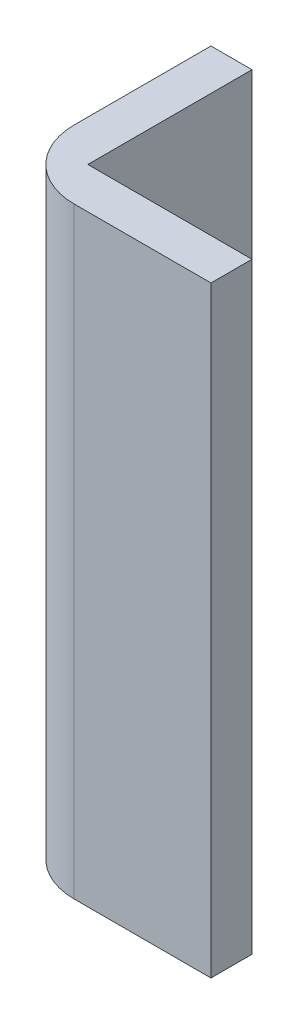
ISO-10303-21;
HEADER;
FILE_DESCRIPTION(('STEP AP214'),'2;1');
FILE_NAME('part.step','',(''),(''),'','','');
FILE_SCHEMA(('AUTOMOTIVE_DESIGN { 1 0 10303 214 1 1 1 1 }'));
ENDSEC;
DATA;
#1=APPLICATION_CONTEXT('core data for automotive mechanical design processes');
#2=APPLICATION_PROTOCOL_DEFINITION('international standard','automotive_design',2000,#1);
#3=PRODUCT_CONTEXT('',#1,'mechanical');
#4=PRODUCT('Part','Part','',(#3));
#5=PRODUCT_RELATED_PRODUCT_CATEGORY('part','',(#4));
#6=PRODUCT_DEFINITION_FORMATION('','',#4);
#7=PRODUCT_DEFINITION_CONTEXT('part definition',#1,'design');
#8=PRODUCT_DEFINITION('design','',#6,#7);
#9=PRODUCT_DEFINITION_SHAPE('','',#8);
#10=(LENGTH_UNIT() NAMED_UNIT(*) SI_UNIT(.MILLI.,.METRE.));
#11=(NAMED_UNIT(*) PLANE_ANGLE_UNIT() SI_UNIT($,.RADIAN.));
#12=(NAMED_UNIT(*) SI_UNIT($,.STERADIAN.) SOLID_ANGLE_UNIT());
#13=UNCERTAINTY_MEASURE_WITH_UNIT(LENGTH_MEASURE(1.E-05),#10,'distance_accuracy_value','');
#14=(GEOMETRIC_REPRESENTATION_CONTEXT(3) GLOBAL_UNCERTAINTY_ASSIGNED_CONTEXT((#13)) GLOBAL_UNIT_ASSIGNED_CONTEXT((#10,
#11,#12)) REPRESENTATION_CONTEXT('',''));
#15=CARTESIAN_POINT('',(0.,0.,0.));
#16=DIRECTION('',(0.,0.,1.));
#17=DIRECTION('',(1.,0.,0.));
#18=AXIS2_PLACEMENT_3D('',#15,#16,#17);
#19=CARTESIAN_POINT('',(-98.3544303797468,-0.0100000000000031,7.15189873417722));
#20=DIRECTION('',(0.,0.,1.));
#21=DIRECTION('',(1.,0.,0.));
#22=AXIS2_PLACEMENT_3D('',#19,#20,#21);
#23=PLANE('',#22);
#24=DIRECTION('',(-1.,0.,0.));
#25=VECTOR('',#24,1.);
#26=CARTESIAN_POINT('',(0.,3.,7.15189873417733));
#27=LINE('',#26,#25);
#28=CARTESIAN_POINT('',(-95.3544303797468,3.,7.15189873417722));
#29=VERTEX_POINT('',#28);
#30=CARTESIAN_POINT('',(-98.3544303797468,3.,7.15189873417722));
#31=VERTEX_POINT('',#30);
#32=EDGE_CURVE('E36',#29,#31,#27,.T.);
#33=ORIENTED_EDGE('',*,*,#32,.T.);
#34=DIRECTION('',(0.,-1.,0.));
#35=VECTOR('',#34,1.);
#36=CARTESIAN_POINT('',(-98.3544303797468,50.,7.15189873417722));
#37=LINE('',#36,#35);
#38=CARTESIAN_POINT('',(-98.3544303797468,47.,7.15189873417722));
#39=VERTEX_POINT('',#38);
#40=EDGE_CURVE('E130',#39,#31,#37,.T.);
#41=ORIENTED_EDGE('',*,*,#40,.F.);
#42=DIRECTION('',(1.,0.,0.));
#43=VECTOR('',#42,1.);
#44=CARTESIAN_POINT('',(0.,47.,7.15189873417733));
#45=LINE('',#44,#43);
#46=CARTESIAN_POINT('',(-95.3544303797468,47.,7.15189873417722));
#47=VERTEX_POINT('',#46);
#48=EDGE_CURVE('E123',#39,#47,#45,.T.);
#49=ORIENTED_EDGE('',*,*,#48,.T.);
#50=DIRECTION('',(0.,1.,0.));
#51=VECTOR('',#50,1.);
#52=CARTESIAN_POINT('',(-95.3544303797468,-0.0100000000000031,7.15189873417722));
#53=LINE('',#52,#51);
#54=EDGE_CURVE('E125',#29,#47,#53,.T.);
#55=ORIENTED_EDGE('',*,*,#54,.F.);
#56=EDGE_LOOP('',(#33,#41,#49,#55));
#57=FACE_BOUND('',#56,.T.);
#58=ADVANCED_FACE('F32',(#57),#23,.F.);
#59=CARTESIAN_POINT('',(-83.3544303797468,-0.0100000000000031,22.1518987341772));
#60=DIRECTION('',(-1.,0.,0.));
#61=DIRECTION('',(0.,0.,1.));
#62=AXIS2_PLACEMENT_3D('',#59,#60,#61);
#63=PLANE('',#62);
#64=DIRECTION('',(0.,0.,-1.));
#65=VECTOR('',#64,1.);
#66=CARTESIAN_POINT('',(-83.3544303797468,3.,0.));
#67=LINE('',#66,#65);
#68=CARTESIAN_POINT('',(-83.3544303797468,3.,22.1518987341772));
#69=VERTEX_POINT('',#68);
#70=CARTESIAN_POINT('',(-83.3544303797468,3.,19.1518987341772));
#71=VERTEX_POINT('',#70);
#72=EDGE_CURVE('E102',#69,#71,#67,.T.);
#73=ORIENTED_EDGE('',*,*,#72,.T.);
#74=DIRECTION('',(0.,1.,0.));
#75=VECTOR('',#74,1.);
#76=CARTESIAN_POINT('',(-83.3544303797468,-0.0100000000000031,19.1518987341772));
#77=LINE('',#76,#75);
#78=CARTESIAN_POINT('',(-83.3544303797468,47.,19.1518987341772));
#79=VERTEX_POINT('',#78);
#80=EDGE_CURVE('E94',#71,#79,#77,.T.);
#81=ORIENTED_EDGE('',*,*,#80,.T.);
#82=DIRECTION('',(0.,0.,1.));
#83=VECTOR('',#82,1.);
#84=CARTESIAN_POINT('',(-83.3544303797468,47.,0.));
#85=LINE('',#84,#83);
#86=CARTESIAN_POINT('',(-83.3544303797468,47.,22.1518987341772));
#87=VERTEX_POINT('',#86);
#88=EDGE_CURVE('E126',#79,#87,#85,.T.);
#89=ORIENTED_EDGE('',*,*,#88,.T.);
#90=DIRECTION('',(0.,1.,0.));
#91=VECTOR('',#90,1.);
#92=CARTESIAN_POINT('',(-83.3544303797468,-0.0100000000000031,22.1518987341772));
#93=LINE('',#92,#91);
#94=EDGE_CURVE('E105',#69,#87,#93,.T.);
#95=ORIENTED_EDGE('',*,*,#94,.F.);
#96=EDGE_LOOP('',(#73,#81,#89,#95));
#97=FACE_BOUND('',#96,.T.);
#98=ADVANCED_FACE('F104',(#97),#63,.F.);
#99=CARTESIAN_POINT('',(-98.3544303797468,47.,19.1518987341772));
#100=DIRECTION('',(0.,0.,-1.));
#101=DIRECTION('',(-1.,0.,0.));
#102=AXIS2_PLACEMENT_3D('',#99,#100,#101);
#103=PLANE('',#102);
#104=ORIENTED_EDGE('',*,*,#80,.F.);
#105=DIRECTION('',(1.,0.,0.));
#106=VECTOR('',#105,1.);
#107=CARTESIAN_POINT('',(-98.3544303797468,3.,19.1518987341772));
#108=LINE('',#107,#106);
#109=CARTESIAN_POINT('',(-95.3544303797468,3.,19.1518987341772));
#110=VERTEX_POINT('',#109);
#111=EDGE_CURVE('E41',#110,#71,#108,.T.);
#112=ORIENTED_EDGE('',*,*,#111,.F.);
#113=DIRECTION('',(0.,-1.,0.));
#114=VECTOR('',#113,1.);
#115=CARTESIAN_POINT('',(-95.3544303797468,47.,19.1518987341772));
#116=LINE('',#115,#114);
#117=CARTESIAN_POINT('',(-95.3544303797468,47.,19.1518987341772));
#118=VERTEX_POINT('',#117);
#119=EDGE_CURVE('E115',#118,#110,#116,.T.);
#120=ORIENTED_EDGE('',*,*,#119,.F.);
#121=DIRECTION('',(1.,0.,0.));
#122=VECTOR('',#121,1.);
#123=CARTESIAN_POINT('',(-98.3544303797468,47.,19.1518987341772));
#124=LINE('',#123,#122);
#125=EDGE_CURVE('E99',#118,#79,#124,.T.);
#126=ORIENTED_EDGE('',*,*,#125,.T.);
#127=EDGE_LOOP('',(#104,#112,#120,#126));
#128=FACE_BOUND('',#127,.T.);
#129=ADVANCED_FACE('F96',(#128),#103,.T.);
#130=CARTESIAN_POINT('',(-93.3544303797468,50.,17.1518987341772));
#131=DIRECTION('',(0.,-1.,0.));
#132=DIRECTION('',(0.,0.,-1.));
#133=AXIS2_PLACEMENT_3D('',#130,#131,#132);
#134=CYLINDRICAL_SURFACE('',#133,5.);
#135=DIRECTION('',(0.,-1.,0.));
#136=VECTOR('',#135,1.);
#137=CARTESIAN_POINT('',(-93.3544303797468,50.,22.1518987341772));
#138=LINE('',#137,#136);
#139=CARTESIAN_POINT('',(-93.3544303797468,47.,22.1518987341772));
#140=VERTEX_POINT('',#139);
#141=CARTESIAN_POINT('',(-93.3544303797468,3.,22.1518987341772));
#142=VERTEX_POINT('',#141);
#143=EDGE_CURVE('E140',#140,#142,#138,.T.);
#144=ORIENTED_EDGE('',*,*,#143,.F.);
#145=CARTESIAN_POINT('',(-93.3544303797468,47.,17.1518987341772));
#146=DIRECTION('',(0.,1.,0.));
#147=DIRECTION('',(0.,0.,1.));
#148=AXIS2_PLACEMENT_3D('',#145,#146,#147);
#149=CIRCLE('',#148,5.);
#150=CARTESIAN_POINT('',(-98.3544303797468,47.,17.1518987341772));
#151=VERTEX_POINT('',#150);
#152=EDGE_CURVE('E122',#140,#151,#149,.F.);
#153=ORIENTED_EDGE('',*,*,#152,.T.);
#154=DIRECTION('',(0.,-1.,0.));
#155=VECTOR('',#154,1.);
#156=CARTESIAN_POINT('',(-98.3544303797468,50.,17.1518987341772));
#157=LINE('',#156,#155);
#158=CARTESIAN_POINT('',(-98.3544303797468,3.,17.1518987341772));
#159=VERTEX_POINT('',#158);
#160=EDGE_CURVE('E137',#159,#151,#157,.F.);
#161=ORIENTED_EDGE('',*,*,#160,.F.);
#162=CARTESIAN_POINT('',(-93.3544303797468,3.,17.1518987341772));
#163=DIRECTION('',(0.,-1.,0.));
#164=DIRECTION('',(0.,0.,-1.));
#165=AXIS2_PLACEMENT_3D('',#162,#163,#164);
#166=CIRCLE('',#165,5.);
#167=EDGE_CURVE('E138',#159,#142,#166,.F.);
#168=ORIENTED_EDGE('',*,*,#167,.T.);
#169=EDGE_LOOP('',(#144,#153,#161,#168));
#170=FACE_BOUND('',#169,.T.);
#171=ADVANCED_FACE('F153',(#170),#134,.T.);
#172=CARTESIAN_POINT('',(0.,47.,0.));
#173=DIRECTION('',(0.,1.,0.));
#174=DIRECTION('',(0.,0.,1.));
#175=AXIS2_PLACEMENT_3D('',#172,#173,#174);
#176=PLANE('',#175);
#177=ORIENTED_EDGE('',*,*,#48,.F.);
#178=DIRECTION('',(0.,0.,1.));
#179=VECTOR('',#178,1.);
#180=CARTESIAN_POINT('',(-98.3544303797468,47.,-47.8481012658228));
#181=LINE('',#180,#179);
#182=EDGE_CURVE('E120',#39,#151,#181,.T.);
#183=ORIENTED_EDGE('',*,*,#182,.T.);
#184=ORIENTED_EDGE('',*,*,#152,.F.);
#185=DIRECTION('',(1.,0.,0.));
#186=VECTOR('',#185,1.);
#187=CARTESIAN_POINT('',(-98.3544303797468,47.,22.1518987341772));
#188=LINE('',#187,#186);
#189=EDGE_CURVE('E109',#140,#87,#188,.T.);
#190=ORIENTED_EDGE('',*,*,#189,.T.);
#191=ORIENTED_EDGE('',*,*,#88,.F.);
#192=ORIENTED_EDGE('',*,*,#125,.F.);
#193=DIRECTION('',(0.,0.,1.));
#194=VECTOR('',#193,1.);
#195=CARTESIAN_POINT('',(-95.3544303797468,47.,-47.8481012658228));
#196=LINE('',#195,#194);
#197=EDGE_CURVE('E116',#47,#118,#196,.T.);
#198=ORIENTED_EDGE('',*,*,#197,.F.);
#199=EDGE_LOOP('',(#177,#183,#184,#190,#191,#192,#198));
#200=FACE_BOUND('',#199,.T.);
#201=ADVANCED_FACE('F158',(#200),#176,.T.);
#202=CARTESIAN_POINT('',(0.,3.,0.));
#203=DIRECTION('',(0.,-1.,0.));
#204=DIRECTION('',(0.,0.,-1.));
#205=AXIS2_PLACEMENT_3D('',#202,#203,#204);
#206=PLANE('',#205);
#207=ORIENTED_EDGE('',*,*,#32,.F.);
#208=DIRECTION('',(0.,0.,1.));
#209=VECTOR('',#208,1.);
#210=CARTESIAN_POINT('',(-95.3544303797468,3.,-47.8481012658228));
#211=LINE('',#210,#209);
#212=EDGE_CURVE('E11',#29,#110,#211,.T.);
#213=ORIENTED_EDGE('',*,*,#212,.T.);
#214=ORIENTED_EDGE('',*,*,#111,.T.);
#215=ORIENTED_EDGE('',*,*,#72,.F.);
#216=DIRECTION('',(-1.,0.,0.));
#217=VECTOR('',#216,1.);
#218=CARTESIAN_POINT('',(-98.3544303797468,3.,22.1518987341772));
#219=LINE('',#218,#217);
#220=EDGE_CURVE('E54',#69,#142,#219,.T.);
#221=ORIENTED_EDGE('',*,*,#220,.T.);
#222=ORIENTED_EDGE('',*,*,#167,.F.);
#223=DIRECTION('',(0.,0.,-1.));
#224=VECTOR('',#223,1.);
#225=CARTESIAN_POINT('',(-98.3544303797468,3.,-47.8481012658228));
#226=LINE('',#225,#224);
#227=EDGE_CURVE('E114',#159,#31,#226,.T.);
#228=ORIENTED_EDGE('',*,*,#227,.T.);
#229=EDGE_LOOP('',(#207,#213,#214,#215,#221,#222,#228));
#230=FACE_BOUND('',#229,.T.);
#231=ADVANCED_FACE('F107',(#230),#206,.T.);
#232=CARTESIAN_POINT('',(-98.3544303797468,50.,22.1518987341772));
#233=DIRECTION('',(0.,0.,-1.));
#234=DIRECTION('',(-1.,0.,0.));
#235=AXIS2_PLACEMENT_3D('',#232,#233,#234);
#236=PLANE('',#235);
#237=ORIENTED_EDGE('',*,*,#220,.F.);
#238=ORIENTED_EDGE('',*,*,#94,.T.);
#239=ORIENTED_EDGE('',*,*,#189,.F.);
#240=ORIENTED_EDGE('',*,*,#143,.T.);
#241=EDGE_LOOP('',(#237,#238,#239,#240));
#242=FACE_BOUND('',#241,.T.);
#243=ADVANCED_FACE('F156',(#242),#236,.F.);
#244=CARTESIAN_POINT('',(-98.3544303797468,50.,-47.8481012658228));
#245=DIRECTION('',(1.,0.,0.));
#246=DIRECTION('',(0.,0.,-1.));
#247=AXIS2_PLACEMENT_3D('',#244,#245,#246);
#248=PLANE('',#247);
#249=ORIENTED_EDGE('',*,*,#182,.F.);
#250=ORIENTED_EDGE('',*,*,#40,.T.);
#251=ORIENTED_EDGE('',*,*,#227,.F.);
#252=ORIENTED_EDGE('',*,*,#160,.T.);
#253=EDGE_LOOP('',(#249,#250,#251,#252));
#254=FACE_BOUND('',#253,.T.);
#255=ADVANCED_FACE('F34',(#254),#248,.F.);
#256=CARTESIAN_POINT('',(-95.3544303797468,47.,-47.8481012658228));
#257=DIRECTION('',(1.,0.,0.));
#258=DIRECTION('',(0.,0.,-1.));
#259=AXIS2_PLACEMENT_3D('',#256,#257,#258);
#260=PLANE('',#259);
#261=ORIENTED_EDGE('',*,*,#212,.F.);
#262=ORIENTED_EDGE('',*,*,#54,.T.);
#263=ORIENTED_EDGE('',*,*,#197,.T.);
#264=ORIENTED_EDGE('',*,*,#119,.T.);
#265=EDGE_LOOP('',(#261,#262,#263,#264));
#266=FACE_BOUND('',#265,.T.);
#267=ADVANCED_FACE('F160',(#266),#260,.T.);
#268=CLOSED_SHELL('',(#58,#98,#129,#171,#201,#231,#243,#255,#267));
#269=MANIFOLD_SOLID_BREP('B2',#268);
#270=ADVANCED_BREP_SHAPE_REPRESENTATION('',(#18,#269),#14);
#271=SHAPE_DEFINITION_REPRESENTATION(#9,#270);
ENDSEC;
END-ISO-10303-21;
